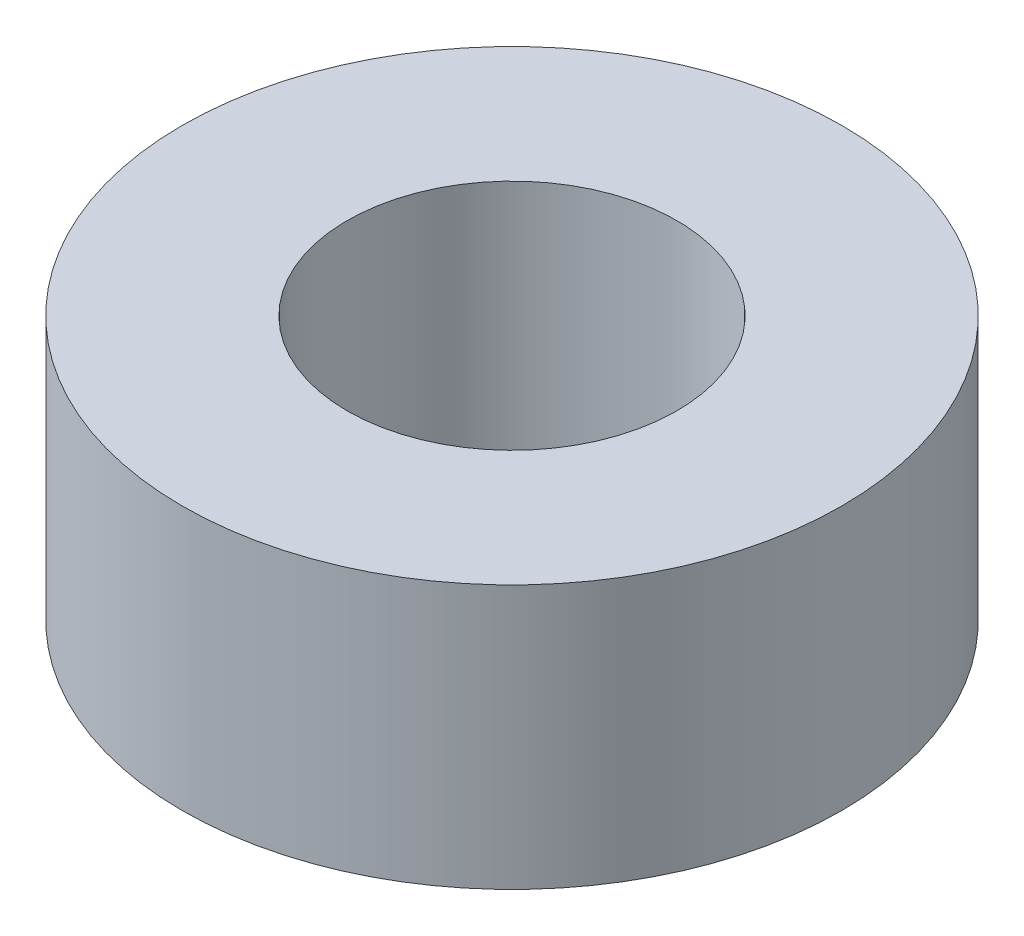
ISO-10303-21;
HEADER;
FILE_DESCRIPTION(('STEP AP214'),'2;1');
FILE_NAME('part.step','',(''),(''),'','','');
FILE_SCHEMA(('AUTOMOTIVE_DESIGN { 1 0 10303 214 1 1 1 1 }'));
ENDSEC;
DATA;
#1=APPLICATION_CONTEXT('core data for automotive mechanical design processes');
#2=APPLICATION_PROTOCOL_DEFINITION('international standard','automotive_design',2000,#1);
#3=PRODUCT_CONTEXT('',#1,'mechanical');
#4=PRODUCT('Part','Part','',(#3));
#5=PRODUCT_RELATED_PRODUCT_CATEGORY('part','',(#4));
#6=PRODUCT_DEFINITION_FORMATION('','',#4);
#7=PRODUCT_DEFINITION_CONTEXT('part definition',#1,'design');
#8=PRODUCT_DEFINITION('design','',#6,#7);
#9=PRODUCT_DEFINITION_SHAPE('','',#8);
#10=(LENGTH_UNIT() NAMED_UNIT(*) SI_UNIT(.MILLI.,.METRE.));
#11=(NAMED_UNIT(*) PLANE_ANGLE_UNIT() SI_UNIT($,.RADIAN.));
#12=(NAMED_UNIT(*) SI_UNIT($,.STERADIAN.) SOLID_ANGLE_UNIT());
#13=UNCERTAINTY_MEASURE_WITH_UNIT(LENGTH_MEASURE(1.E-05),#10,'distance_accuracy_value','');
#14=(GEOMETRIC_REPRESENTATION_CONTEXT(3) GLOBAL_UNCERTAINTY_ASSIGNED_CONTEXT((#13)) GLOBAL_UNIT_ASSIGNED_CONTEXT((#10,
#11,#12)) REPRESENTATION_CONTEXT('',''));
#15=CARTESIAN_POINT('',(0.,0.,0.));
#16=DIRECTION('',(0.,0.,1.));
#17=DIRECTION('',(1.,0.,0.));
#18=AXIS2_PLACEMENT_3D('',#15,#16,#17);
#19=CARTESIAN_POINT('',(0.,2.,0.));
#20=DIRECTION('',(0.,1.,0.));
#21=DIRECTION('',(0.,0.,1.));
#22=AXIS2_PLACEMENT_3D('',#19,#20,#21);
#23=PLANE('',#22);
#24=CARTESIAN_POINT('',(0.,2.,0.));
#25=DIRECTION('',(0.,1.,0.));
#26=DIRECTION('',(0.,0.,1.));
#27=AXIS2_PLACEMENT_3D('',#24,#25,#26);
#28=CIRCLE('',#27,5.);
#29=CARTESIAN_POINT('',(0.,2.,5.));
#30=VERTEX_POINT('',#29);
#31=EDGE_CURVE('E10',#30,#30,#28,.T.);
#32=ORIENTED_EDGE('',*,*,#31,.T.);
#33=EDGE_LOOP('',(#32));
#34=FACE_BOUND('',#33,.T.);
#35=CARTESIAN_POINT('',(0.,2.,0.));
#36=DIRECTION('',(0.,1.,0.));
#37=DIRECTION('',(0.,0.,1.));
#38=AXIS2_PLACEMENT_3D('',#35,#36,#37);
#39=CIRCLE('',#38,2.5);
#40=CARTESIAN_POINT('',(0.,2.,2.5));
#41=VERTEX_POINT('',#40);
#42=EDGE_CURVE('E43',#41,#41,#39,.T.);
#43=ORIENTED_EDGE('',*,*,#42,.F.);
#44=EDGE_LOOP('',(#43));
#45=FACE_BOUND('',#44,.T.);
#46=ADVANCED_FACE('F32',(#34,#45),#23,.T.);
#47=CARTESIAN_POINT('',(0.,-2.,0.));
#48=DIRECTION('',(0.,1.,0.));
#49=DIRECTION('',(0.,0.,1.));
#50=AXIS2_PLACEMENT_3D('',#47,#48,#49);
#51=PLANE('',#50);
#52=CARTESIAN_POINT('',(0.,-2.,0.));
#53=DIRECTION('',(0.,1.,0.));
#54=DIRECTION('',(0.,0.,1.));
#55=AXIS2_PLACEMENT_3D('',#52,#53,#54);
#56=CIRCLE('',#55,5.);
#57=CARTESIAN_POINT('',(0.,-2.,5.));
#58=VERTEX_POINT('',#57);
#59=EDGE_CURVE('E36',#58,#58,#56,.T.);
#60=ORIENTED_EDGE('',*,*,#59,.F.);
#61=EDGE_LOOP('',(#60));
#62=FACE_BOUND('',#61,.T.);
#63=CARTESIAN_POINT('',(0.,-2.,0.));
#64=DIRECTION('',(0.,1.,0.));
#65=DIRECTION('',(0.,0.,1.));
#66=AXIS2_PLACEMENT_3D('',#63,#64,#65);
#67=CIRCLE('',#66,2.5);
#68=CARTESIAN_POINT('',(0.,-2.,2.5));
#69=VERTEX_POINT('',#68);
#70=EDGE_CURVE('E45',#69,#69,#67,.T.);
#71=ORIENTED_EDGE('',*,*,#70,.T.);
#72=EDGE_LOOP('',(#71));
#73=FACE_BOUND('',#72,.T.);
#74=ADVANCED_FACE('F55',(#62,#73),#51,.F.);
#75=CARTESIAN_POINT('',(0.,2.,0.));
#76=DIRECTION('',(0.,-1.,0.));
#77=DIRECTION('',(0.,0.,-1.));
#78=AXIS2_PLACEMENT_3D('',#75,#76,#77);
#79=CYLINDRICAL_SURFACE('',#78,5.);
#80=ORIENTED_EDGE('',*,*,#31,.F.);
#81=EDGE_LOOP('',(#80));
#82=FACE_BOUND('',#81,.T.);
#83=ORIENTED_EDGE('',*,*,#59,.T.);
#84=EDGE_LOOP('',(#83));
#85=FACE_BOUND('',#84,.T.);
#86=ADVANCED_FACE('F34',(#82,#85),#79,.T.);
#87=CARTESIAN_POINT('',(0.,2.,0.));
#88=DIRECTION('',(0.,-1.,0.));
#89=DIRECTION('',(0.,0.,-1.));
#90=AXIS2_PLACEMENT_3D('',#87,#88,#89);
#91=CYLINDRICAL_SURFACE('',#90,2.5);
#92=ORIENTED_EDGE('',*,*,#42,.T.);
#93=EDGE_LOOP('',(#92));
#94=FACE_BOUND('',#93,.T.);
#95=ORIENTED_EDGE('',*,*,#70,.F.);
#96=EDGE_LOOP('',(#95));
#97=FACE_BOUND('',#96,.T.);
#98=ADVANCED_FACE('F51',(#94,#97),#91,.F.);
#99=CLOSED_SHELL('',(#46,#74,#86,#98));
#100=MANIFOLD_SOLID_BREP('B2',#99);
#101=ADVANCED_BREP_SHAPE_REPRESENTATION('',(#18,#100),#14);
#102=SHAPE_DEFINITION_REPRESENTATION(#9,#101);
ENDSEC;
END-ISO-10303-21;
